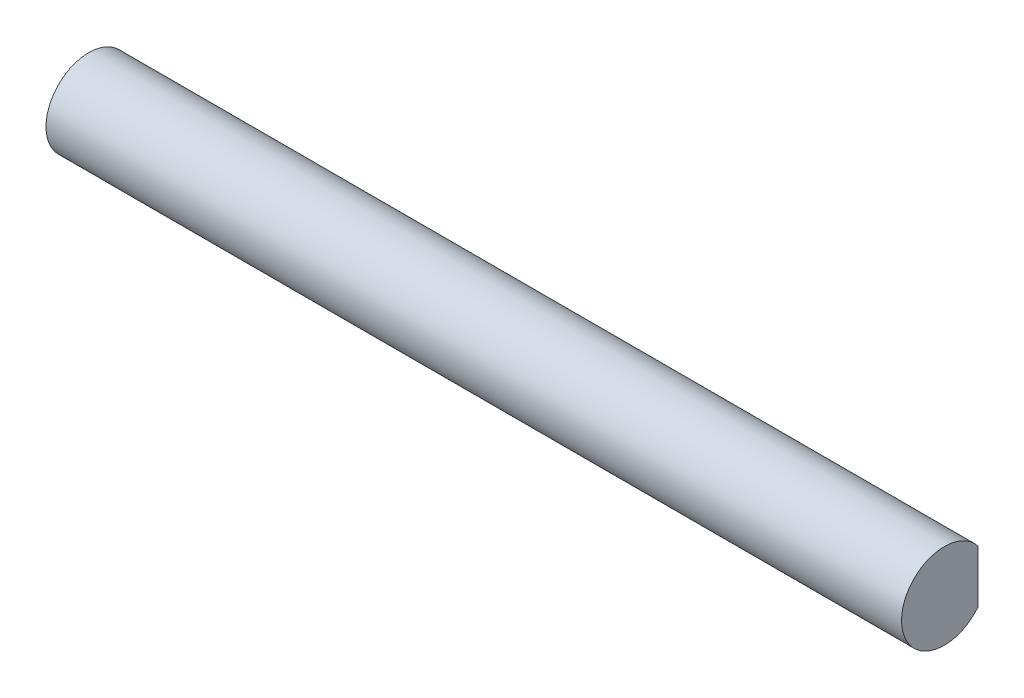
ISO-10303-21;
HEADER;
FILE_DESCRIPTION(('STEP AP214'),'2;1');
FILE_NAME('part.step','',(''),(''),'','','');
FILE_SCHEMA(('AUTOMOTIVE_DESIGN { 1 0 10303 214 1 1 1 1 }'));
ENDSEC;
DATA;
#1=APPLICATION_CONTEXT('core data for automotive mechanical design processes');
#2=APPLICATION_PROTOCOL_DEFINITION('international standard','automotive_design',2000,#1);
#3=PRODUCT_CONTEXT('',#1,'mechanical');
#4=PRODUCT('Part','Part','',(#3));
#5=PRODUCT_RELATED_PRODUCT_CATEGORY('part','',(#4));
#6=PRODUCT_DEFINITION_FORMATION('','',#4);
#7=PRODUCT_DEFINITION_CONTEXT('part definition',#1,'design');
#8=PRODUCT_DEFINITION('design','',#6,#7);
#9=PRODUCT_DEFINITION_SHAPE('','',#8);
#10=(LENGTH_UNIT() NAMED_UNIT(*) SI_UNIT(.MILLI.,.METRE.));
#11=(NAMED_UNIT(*) PLANE_ANGLE_UNIT() SI_UNIT($,.RADIAN.));
#12=(NAMED_UNIT(*) SI_UNIT($,.STERADIAN.) SOLID_ANGLE_UNIT());
#13=UNCERTAINTY_MEASURE_WITH_UNIT(LENGTH_MEASURE(1.E-05),#10,'distance_accuracy_value','');
#14=(GEOMETRIC_REPRESENTATION_CONTEXT(3) GLOBAL_UNCERTAINTY_ASSIGNED_CONTEXT((#13)) GLOBAL_UNIT_ASSIGNED_CONTEXT((#10,
#11,#12)) REPRESENTATION_CONTEXT('',''));
#15=CARTESIAN_POINT('',(0.,0.,0.));
#16=DIRECTION('',(0.,0.,1.));
#17=DIRECTION('',(1.,0.,0.));
#18=AXIS2_PLACEMENT_3D('',#15,#16,#17);
#19=CARTESIAN_POINT('',(60.,0.,0.));
#20=DIRECTION('',(-1.,0.,0.));
#21=DIRECTION('',(0.,0.,1.));
#22=AXIS2_PLACEMENT_3D('',#19,#20,#21);
#23=CYLINDRICAL_SURFACE('',#22,3.);
#24=CARTESIAN_POINT('',(0.,0.,0.));
#25=DIRECTION('',(1.,0.,0.));
#26=DIRECTION('',(0.,0.,-1.));
#27=AXIS2_PLACEMENT_3D('',#24,#25,#26);
#28=CIRCLE('',#27,3.);
#29=CARTESIAN_POINT('',(0.,1.85,-2.36167313572391));
#30=VERTEX_POINT('',#29);
#31=CARTESIAN_POINT('',(0.,-1.85,-2.36167313572391));
#32=VERTEX_POINT('',#31);
#33=EDGE_CURVE('E70',#30,#32,#28,.T.);
#34=ORIENTED_EDGE('',*,*,#33,.T.);
#35=DIRECTION('',(-1.,0.,0.));
#36=VECTOR('',#35,1.);
#37=CARTESIAN_POINT('',(60.,-1.85,-2.36167313572391));
#38=LINE('',#37,#36);
#39=CARTESIAN_POINT('',(60.,-1.85,-2.36167313572391));
#40=VERTEX_POINT('',#39);
#41=EDGE_CURVE('E11',#40,#32,#38,.T.);
#42=ORIENTED_EDGE('',*,*,#41,.F.);
#43=CARTESIAN_POINT('',(60.,0.,0.));
#44=DIRECTION('',(1.,0.,0.));
#45=DIRECTION('',(0.,0.,-1.));
#46=AXIS2_PLACEMENT_3D('',#43,#44,#45);
#47=CIRCLE('',#46,3.);
#48=CARTESIAN_POINT('',(60.,1.85,-2.36167313572391));
#49=VERTEX_POINT('',#48);
#50=EDGE_CURVE('E69',#49,#40,#47,.T.);
#51=ORIENTED_EDGE('',*,*,#50,.F.);
#52=DIRECTION('',(-1.,0.,0.));
#53=VECTOR('',#52,1.);
#54=CARTESIAN_POINT('',(60.,1.85,-2.36167313572391));
#55=LINE('',#54,#53);
#56=EDGE_CURVE('E47',#49,#30,#55,.T.);
#57=ORIENTED_EDGE('',*,*,#56,.T.);
#58=EDGE_LOOP('',(#34,#42,#51,#57));
#59=FACE_BOUND('',#58,.T.);
#60=ADVANCED_FACE('F39',(#59),#23,.T.);
#61=CARTESIAN_POINT('',(60.,1.85,-2.36167313572391));
#62=DIRECTION('',(0.,0.,1.));
#63=DIRECTION('',(1.,0.,0.));
#64=AXIS2_PLACEMENT_3D('',#61,#62,#63);
#65=PLANE('',#64);
#66=DIRECTION('',(0.,1.,0.));
#67=VECTOR('',#66,1.);
#68=CARTESIAN_POINT('',(0.,1.85,-2.36167313572391));
#69=LINE('',#68,#67);
#70=EDGE_CURVE('E62',#32,#30,#69,.T.);
#71=ORIENTED_EDGE('',*,*,#70,.T.);
#72=ORIENTED_EDGE('',*,*,#56,.F.);
#73=DIRECTION('',(0.,1.,0.));
#74=VECTOR('',#73,1.);
#75=CARTESIAN_POINT('',(60.,1.85,-2.36167313572391));
#76=LINE('',#75,#74);
#77=EDGE_CURVE('E54',#40,#49,#76,.T.);
#78=ORIENTED_EDGE('',*,*,#77,.F.);
#79=ORIENTED_EDGE('',*,*,#41,.T.);
#80=EDGE_LOOP('',(#71,#72,#78,#79));
#81=FACE_BOUND('',#80,.T.);
#82=ADVANCED_FACE('F65',(#81),#65,.F.);
#83=CARTESIAN_POINT('',(60.,0.,0.));
#84=DIRECTION('',(1.,0.,0.));
#85=DIRECTION('',(0.,0.,-1.));
#86=AXIS2_PLACEMENT_3D('',#83,#84,#85);
#87=PLANE('',#86);
#88=ORIENTED_EDGE('',*,*,#50,.T.);
#89=ORIENTED_EDGE('',*,*,#77,.T.);
#90=EDGE_LOOP('',(#88,#89));
#91=FACE_BOUND('',#90,.T.);
#92=ADVANCED_FACE('F77',(#91),#87,.T.);
#93=CARTESIAN_POINT('',(0.,0.,0.));
#94=DIRECTION('',(1.,0.,0.));
#95=DIRECTION('',(0.,0.,-1.));
#96=AXIS2_PLACEMENT_3D('',#93,#94,#95);
#97=PLANE('',#96);
#98=ORIENTED_EDGE('',*,*,#33,.F.);
#99=ORIENTED_EDGE('',*,*,#70,.F.);
#100=EDGE_LOOP('',(#98,#99));
#101=FACE_BOUND('',#100,.T.);
#102=ADVANCED_FACE('F73',(#101),#97,.F.);
#103=CLOSED_SHELL('',(#60,#82,#92,#102));
#104=MANIFOLD_SOLID_BREP('B2',#103);
#105=ADVANCED_BREP_SHAPE_REPRESENTATION('',(#18,#104),#14);
#106=SHAPE_DEFINITION_REPRESENTATION(#9,#105);
ENDSEC;
END-ISO-10303-21;
